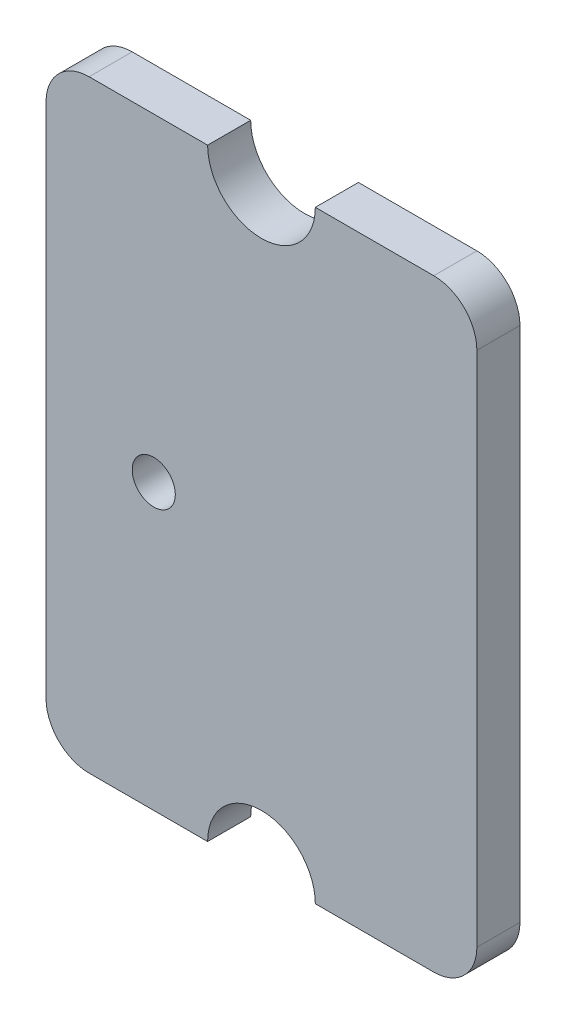
ISO-10303-21;
HEADER;
FILE_DESCRIPTION(('STEP AP214'),'2;1');
FILE_NAME('part.step','',(''),(''),'','','');
FILE_SCHEMA(('AUTOMOTIVE_DESIGN { 1 0 10303 214 1 1 1 1 }'));
ENDSEC;
DATA;
#1=APPLICATION_CONTEXT('core data for automotive mechanical design processes');
#2=APPLICATION_PROTOCOL_DEFINITION('international standard','automotive_design',2000,#1);
#3=PRODUCT_CONTEXT('',#1,'mechanical');
#4=PRODUCT('Part','Part','',(#3));
#5=PRODUCT_RELATED_PRODUCT_CATEGORY('part','',(#4));
#6=PRODUCT_DEFINITION_FORMATION('','',#4);
#7=PRODUCT_DEFINITION_CONTEXT('part definition',#1,'design');
#8=PRODUCT_DEFINITION('design','',#6,#7);
#9=PRODUCT_DEFINITION_SHAPE('','',#8);
#10=(LENGTH_UNIT() NAMED_UNIT(*) SI_UNIT(.MILLI.,.METRE.));
#11=(NAMED_UNIT(*) PLANE_ANGLE_UNIT() SI_UNIT($,.RADIAN.));
#12=(NAMED_UNIT(*) SI_UNIT($,.STERADIAN.) SOLID_ANGLE_UNIT());
#13=UNCERTAINTY_MEASURE_WITH_UNIT(LENGTH_MEASURE(1.E-05),#10,'distance_accuracy_value','');
#14=(GEOMETRIC_REPRESENTATION_CONTEXT(3) GLOBAL_UNCERTAINTY_ASSIGNED_CONTEXT((#13)) GLOBAL_UNIT_ASSIGNED_CONTEXT((#10,
#11,#12)) REPRESENTATION_CONTEXT('',''));
#15=CARTESIAN_POINT('',(0.,0.,0.));
#16=DIRECTION('',(0.,0.,1.));
#17=DIRECTION('',(1.,0.,0.));
#18=AXIS2_PLACEMENT_3D('',#15,#16,#17);
#19=CARTESIAN_POINT('',(4.,6.,1.));
#20=DIRECTION('',(0.,0.,-1.));
#21=DIRECTION('',(-1.,0.,0.));
#22=AXIS2_PLACEMENT_3D('',#19,#20,#21);
#23=PLANE('',#22);
#24=CARTESIAN_POINT('',(4.,6.,1.));
#25=DIRECTION('',(0.,0.,1.));
#26=DIRECTION('',(-1.,0.,0.));
#27=AXIS2_PLACEMENT_3D('',#24,#25,#26);
#28=CIRCLE('',#27,1.);
#29=CARTESIAN_POINT('',(5.,5.99999999999999,1.));
#30=VERTEX_POINT('',#29);
#31=CARTESIAN_POINT('',(3.99999999999999,7.,1.));
#32=VERTEX_POINT('',#31);
#33=EDGE_CURVE('E179',#30,#32,#28,.T.);
#34=ORIENTED_EDGE('',*,*,#33,.T.);
#35=DIRECTION('',(-1.,0.,0.));
#36=VECTOR('',#35,1.);
#37=CARTESIAN_POINT('',(1.25,7.,1.));
#38=LINE('',#37,#36);
#39=CARTESIAN_POINT('',(1.25,7.,1.));
#40=VERTEX_POINT('',#39);
#41=EDGE_CURVE('E107',#32,#40,#38,.T.);
#42=ORIENTED_EDGE('',*,*,#41,.T.);
#43=CARTESIAN_POINT('',(0.,7.,1.));
#44=DIRECTION('',(0.,0.,-1.));
#45=DIRECTION('',(1.,0.,0.));
#46=AXIS2_PLACEMENT_3D('',#43,#44,#45);
#47=CIRCLE('',#46,1.25);
#48=CARTESIAN_POINT('',(-1.25,7.,1.));
#49=VERTEX_POINT('',#48);
#50=EDGE_CURVE('E206',#40,#49,#47,.T.);
#51=ORIENTED_EDGE('',*,*,#50,.T.);
#52=DIRECTION('',(-1.,0.,0.));
#53=VECTOR('',#52,1.);
#54=CARTESIAN_POINT('',(-3.99999999999999,7.,1.));
#55=LINE('',#54,#53);
#56=CARTESIAN_POINT('',(-3.99999999999999,7.,1.));
#57=VERTEX_POINT('',#56);
#58=EDGE_CURVE('E225',#49,#57,#55,.T.);
#59=ORIENTED_EDGE('',*,*,#58,.T.);
#60=CARTESIAN_POINT('',(-4.,6.,1.));
#61=DIRECTION('',(0.,0.,1.));
#62=DIRECTION('',(1.,0.,0.));
#63=AXIS2_PLACEMENT_3D('',#60,#61,#62);
#64=CIRCLE('',#63,1.);
#65=CARTESIAN_POINT('',(-5.,5.99999999999999,1.));
#66=VERTEX_POINT('',#65);
#67=EDGE_CURVE('E222',#57,#66,#64,.T.);
#68=ORIENTED_EDGE('',*,*,#67,.T.);
#69=DIRECTION('',(0.,-1.,0.));
#70=VECTOR('',#69,1.);
#71=CARTESIAN_POINT('',(-5.,5.99999999999999,1.));
#72=LINE('',#71,#70);
#73=CARTESIAN_POINT('',(-5.,-5.99999999999999,1.));
#74=VERTEX_POINT('',#73);
#75=EDGE_CURVE('E224',#66,#74,#72,.T.);
#76=ORIENTED_EDGE('',*,*,#75,.T.);
#77=CARTESIAN_POINT('',(-4.,-6.,1.));
#78=DIRECTION('',(0.,0.,1.));
#79=DIRECTION('',(1.,0.,0.));
#80=AXIS2_PLACEMENT_3D('',#77,#78,#79);
#81=CIRCLE('',#80,1.);
#82=CARTESIAN_POINT('',(-3.99999999999999,-7.,1.));
#83=VERTEX_POINT('',#82);
#84=EDGE_CURVE('E227',#74,#83,#81,.T.);
#85=ORIENTED_EDGE('',*,*,#84,.T.);
#86=DIRECTION('',(1.,0.,0.));
#87=VECTOR('',#86,1.);
#88=CARTESIAN_POINT('',(-3.99999999999999,-7.,1.));
#89=LINE('',#88,#87);
#90=CARTESIAN_POINT('',(-1.25,-7.,1.));
#91=VERTEX_POINT('',#90);
#92=EDGE_CURVE('E233',#83,#91,#89,.T.);
#93=ORIENTED_EDGE('',*,*,#92,.T.);
#94=CARTESIAN_POINT('',(0.,-7.,1.));
#95=DIRECTION('',(0.,0.,-1.));
#96=DIRECTION('',(1.,0.,0.));
#97=AXIS2_PLACEMENT_3D('',#94,#95,#96);
#98=CIRCLE('',#97,1.25);
#99=CARTESIAN_POINT('',(1.25,-7.,1.));
#100=VERTEX_POINT('',#99);
#101=EDGE_CURVE('E138',#91,#100,#98,.T.);
#102=ORIENTED_EDGE('',*,*,#101,.T.);
#103=DIRECTION('',(1.,0.,0.));
#104=VECTOR('',#103,1.);
#105=CARTESIAN_POINT('',(1.25,-7.,1.));
#106=LINE('',#105,#104);
#107=CARTESIAN_POINT('',(3.99999999999999,-7.,1.));
#108=VERTEX_POINT('',#107);
#109=EDGE_CURVE('E132',#100,#108,#106,.T.);
#110=ORIENTED_EDGE('',*,*,#109,.T.);
#111=CARTESIAN_POINT('',(4.,-6.,1.));
#112=DIRECTION('',(0.,0.,1.));
#113=DIRECTION('',(1.,0.,0.));
#114=AXIS2_PLACEMENT_3D('',#111,#112,#113);
#115=CIRCLE('',#114,1.);
#116=CARTESIAN_POINT('',(5.,-6.,1.));
#117=VERTEX_POINT('',#116);
#118=EDGE_CURVE('E136',#108,#117,#115,.T.);
#119=ORIENTED_EDGE('',*,*,#118,.T.);
#120=DIRECTION('',(0.,1.,0.));
#121=VECTOR('',#120,1.);
#122=CARTESIAN_POINT('',(5.,5.99999999999999,1.));
#123=LINE('',#122,#121);
#124=EDGE_CURVE('E52',#117,#30,#123,.T.);
#125=ORIENTED_EDGE('',*,*,#124,.T.);
#126=EDGE_LOOP('',(#34,#42,#51,#59,#68,#76,#85,#93,#102,#110,#119,#125));
#127=FACE_BOUND('',#126,.T.);
#128=CARTESIAN_POINT('',(-2.5,-0.399999999999998,1.));
#129=DIRECTION('',(0.,0.,1.));
#130=DIRECTION('',(1.,0.,0.));
#131=AXIS2_PLACEMENT_3D('',#128,#129,#130);
#132=CIRCLE('',#131,0.5);
#133=CARTESIAN_POINT('',(-2.,-0.399999999999998,1.));
#134=VERTEX_POINT('',#133);
#135=EDGE_CURVE('E160',#134,#134,#132,.T.);
#136=ORIENTED_EDGE('',*,*,#135,.F.);
#137=EDGE_LOOP('',(#136));
#138=FACE_BOUND('',#137,.T.);
#139=ADVANCED_FACE('F35',(#127,#138),#23,.F.);
#140=CARTESIAN_POINT('',(4.,6.,0.));
#141=DIRECTION('',(0.,0.,-1.));
#142=DIRECTION('',(-1.,0.,0.));
#143=AXIS2_PLACEMENT_3D('',#140,#141,#142);
#144=PLANE('',#143);
#145=CARTESIAN_POINT('',(4.,6.,0.));
#146=DIRECTION('',(0.,0.,1.));
#147=DIRECTION('',(-1.,0.,0.));
#148=AXIS2_PLACEMENT_3D('',#145,#146,#147);
#149=CIRCLE('',#148,1.);
#150=CARTESIAN_POINT('',(5.,5.99999999999999,0.));
#151=VERTEX_POINT('',#150);
#152=CARTESIAN_POINT('',(3.99999999999999,7.,0.));
#153=VERTEX_POINT('',#152);
#154=EDGE_CURVE('E156',#151,#153,#149,.T.);
#155=ORIENTED_EDGE('',*,*,#154,.F.);
#156=DIRECTION('',(0.,1.,0.));
#157=VECTOR('',#156,1.);
#158=CARTESIAN_POINT('',(5.,5.99999999999999,0.));
#159=LINE('',#158,#157);
#160=CARTESIAN_POINT('',(5.,-6.,0.));
#161=VERTEX_POINT('',#160);
#162=EDGE_CURVE('E99',#161,#151,#159,.T.);
#163=ORIENTED_EDGE('',*,*,#162,.F.);
#164=CARTESIAN_POINT('',(4.,-6.,0.));
#165=DIRECTION('',(0.,0.,1.));
#166=DIRECTION('',(1.,0.,0.));
#167=AXIS2_PLACEMENT_3D('',#164,#165,#166);
#168=CIRCLE('',#167,1.);
#169=CARTESIAN_POINT('',(3.99999999999999,-7.,0.));
#170=VERTEX_POINT('',#169);
#171=EDGE_CURVE('E93',#170,#161,#168,.T.);
#172=ORIENTED_EDGE('',*,*,#171,.F.);
#173=DIRECTION('',(1.,0.,0.));
#174=VECTOR('',#173,1.);
#175=CARTESIAN_POINT('',(1.25,-7.,0.));
#176=LINE('',#175,#174);
#177=CARTESIAN_POINT('',(1.25,-7.,0.));
#178=VERTEX_POINT('',#177);
#179=EDGE_CURVE('E146',#178,#170,#176,.T.);
#180=ORIENTED_EDGE('',*,*,#179,.F.);
#181=CARTESIAN_POINT('',(0.,-7.,0.));
#182=DIRECTION('',(0.,0.,-1.));
#183=DIRECTION('',(1.,0.,0.));
#184=AXIS2_PLACEMENT_3D('',#181,#182,#183);
#185=CIRCLE('',#184,1.25);
#186=CARTESIAN_POINT('',(-1.25,-7.,0.));
#187=VERTEX_POINT('',#186);
#188=EDGE_CURVE('E174',#187,#178,#185,.T.);
#189=ORIENTED_EDGE('',*,*,#188,.F.);
#190=DIRECTION('',(1.,0.,0.));
#191=VECTOR('',#190,1.);
#192=CARTESIAN_POINT('',(-3.99999999999999,-7.,0.));
#193=LINE('',#192,#191);
#194=CARTESIAN_POINT('',(-3.99999999999999,-7.,0.));
#195=VERTEX_POINT('',#194);
#196=EDGE_CURVE('E172',#195,#187,#193,.T.);
#197=ORIENTED_EDGE('',*,*,#196,.F.);
#198=CARTESIAN_POINT('',(-4.,-6.,0.));
#199=DIRECTION('',(0.,0.,1.));
#200=DIRECTION('',(1.,0.,0.));
#201=AXIS2_PLACEMENT_3D('',#198,#199,#200);
#202=CIRCLE('',#201,1.);
#203=CARTESIAN_POINT('',(-5.,-5.99999999999999,0.));
#204=VERTEX_POINT('',#203);
#205=EDGE_CURVE('E170',#204,#195,#202,.T.);
#206=ORIENTED_EDGE('',*,*,#205,.F.);
#207=DIRECTION('',(0.,-1.,0.));
#208=VECTOR('',#207,1.);
#209=CARTESIAN_POINT('',(-5.,5.99999999999999,0.));
#210=LINE('',#209,#208);
#211=CARTESIAN_POINT('',(-5.,5.99999999999999,0.));
#212=VERTEX_POINT('',#211);
#213=EDGE_CURVE('E168',#212,#204,#210,.T.);
#214=ORIENTED_EDGE('',*,*,#213,.F.);
#215=CARTESIAN_POINT('',(-4.,6.,0.));
#216=DIRECTION('',(0.,0.,1.));
#217=DIRECTION('',(1.,0.,0.));
#218=AXIS2_PLACEMENT_3D('',#215,#216,#217);
#219=CIRCLE('',#218,1.);
#220=CARTESIAN_POINT('',(-3.99999999999999,7.,0.));
#221=VERTEX_POINT('',#220);
#222=EDGE_CURVE('E166',#221,#212,#219,.T.);
#223=ORIENTED_EDGE('',*,*,#222,.F.);
#224=DIRECTION('',(-1.,0.,0.));
#225=VECTOR('',#224,1.);
#226=CARTESIAN_POINT('',(-3.99999999999999,7.,0.));
#227=LINE('',#226,#225);
#228=CARTESIAN_POINT('',(-1.25,7.,0.));
#229=VERTEX_POINT('',#228);
#230=EDGE_CURVE('E164',#229,#221,#227,.T.);
#231=ORIENTED_EDGE('',*,*,#230,.F.);
#232=CARTESIAN_POINT('',(0.,7.,0.));
#233=DIRECTION('',(0.,0.,-1.));
#234=DIRECTION('',(1.,0.,0.));
#235=AXIS2_PLACEMENT_3D('',#232,#233,#234);
#236=CIRCLE('',#235,1.25);
#237=CARTESIAN_POINT('',(1.25,7.,0.));
#238=VERTEX_POINT('',#237);
#239=EDGE_CURVE('E162',#238,#229,#236,.T.);
#240=ORIENTED_EDGE('',*,*,#239,.F.);
#241=DIRECTION('',(-1.,0.,0.));
#242=VECTOR('',#241,1.);
#243=CARTESIAN_POINT('',(1.25,7.,0.));
#244=LINE('',#243,#242);
#245=EDGE_CURVE('E159',#153,#238,#244,.T.);
#246=ORIENTED_EDGE('',*,*,#245,.F.);
#247=EDGE_LOOP('',(#155,#163,#172,#180,#189,#197,#206,#214,#223,#231,#240,#246));
#248=FACE_BOUND('',#247,.T.);
#249=CARTESIAN_POINT('',(-2.5,-0.399999999999998,0.));
#250=DIRECTION('',(0.,0.,1.));
#251=DIRECTION('',(1.,0.,0.));
#252=AXIS2_PLACEMENT_3D('',#249,#250,#251);
#253=CIRCLE('',#252,0.5);
#254=CARTESIAN_POINT('',(-2.,-0.399999999999998,0.));
#255=VERTEX_POINT('',#254);
#256=EDGE_CURVE('E380',#255,#255,#253,.T.);
#257=ORIENTED_EDGE('',*,*,#256,.T.);
#258=EDGE_LOOP('',(#257));
#259=FACE_BOUND('',#258,.T.);
#260=ADVANCED_FACE('F210',(#248,#259),#144,.T.);
#261=CARTESIAN_POINT('',(4.,6.,1.));
#262=DIRECTION('',(0.,0.,-1.));
#263=DIRECTION('',(-1.,0.,0.));
#264=AXIS2_PLACEMENT_3D('',#261,#262,#263);
#265=CYLINDRICAL_SURFACE('',#264,1.);
#266=ORIENTED_EDGE('',*,*,#154,.T.);
#267=DIRECTION('',(0.,0.,-1.));
#268=VECTOR('',#267,1.);
#269=CARTESIAN_POINT('',(3.99999999999999,7.,1.));
#270=LINE('',#269,#268);
#271=EDGE_CURVE('E11',#32,#153,#270,.T.);
#272=ORIENTED_EDGE('',*,*,#271,.F.);
#273=ORIENTED_EDGE('',*,*,#33,.F.);
#274=DIRECTION('',(0.,0.,-1.));
#275=VECTOR('',#274,1.);
#276=CARTESIAN_POINT('',(5.,5.99999999999999,1.));
#277=LINE('',#276,#275);
#278=EDGE_CURVE('E152',#30,#151,#277,.T.);
#279=ORIENTED_EDGE('',*,*,#278,.T.);
#280=EDGE_LOOP('',(#266,#272,#273,#279));
#281=FACE_BOUND('',#280,.T.);
#282=ADVANCED_FACE('F37',(#281),#265,.T.);
#283=CARTESIAN_POINT('',(1.25,7.,1.));
#284=DIRECTION('',(0.,-1.,0.));
#285=DIRECTION('',(0.,0.,-1.));
#286=AXIS2_PLACEMENT_3D('',#283,#284,#285);
#287=PLANE('',#286);
#288=ORIENTED_EDGE('',*,*,#245,.T.);
#289=DIRECTION('',(0.,0.,-1.));
#290=VECTOR('',#289,1.);
#291=CARTESIAN_POINT('',(1.25,7.,1.));
#292=LINE('',#291,#290);
#293=EDGE_CURVE('E44',#40,#238,#292,.T.);
#294=ORIENTED_EDGE('',*,*,#293,.F.);
#295=ORIENTED_EDGE('',*,*,#41,.F.);
#296=ORIENTED_EDGE('',*,*,#271,.T.);
#297=EDGE_LOOP('',(#288,#294,#295,#296));
#298=FACE_BOUND('',#297,.T.);
#299=ADVANCED_FACE('F267',(#298),#287,.F.);
#300=CARTESIAN_POINT('',(0.,7.,1.));
#301=DIRECTION('',(0.,0.,-1.));
#302=DIRECTION('',(-1.,0.,0.));
#303=AXIS2_PLACEMENT_3D('',#300,#301,#302);
#304=CYLINDRICAL_SURFACE('',#303,1.25);
#305=ORIENTED_EDGE('',*,*,#239,.T.);
#306=DIRECTION('',(0.,0.,-1.));
#307=VECTOR('',#306,1.);
#308=CARTESIAN_POINT('',(-1.25,7.,1.));
#309=LINE('',#308,#307);
#310=EDGE_CURVE('E198',#49,#229,#309,.T.);
#311=ORIENTED_EDGE('',*,*,#310,.F.);
#312=ORIENTED_EDGE('',*,*,#50,.F.);
#313=ORIENTED_EDGE('',*,*,#293,.T.);
#314=EDGE_LOOP('',(#305,#311,#312,#313));
#315=FACE_BOUND('',#314,.T.);
#316=ADVANCED_FACE('F204',(#315),#304,.F.);
#317=CARTESIAN_POINT('',(-3.99999999999999,7.,1.));
#318=DIRECTION('',(0.,-1.,0.));
#319=DIRECTION('',(0.,0.,-1.));
#320=AXIS2_PLACEMENT_3D('',#317,#318,#319);
#321=PLANE('',#320);
#322=ORIENTED_EDGE('',*,*,#230,.T.);
#323=DIRECTION('',(0.,0.,-1.));
#324=VECTOR('',#323,1.);
#325=CARTESIAN_POINT('',(-3.99999999999999,7.,1.));
#326=LINE('',#325,#324);
#327=EDGE_CURVE('E195',#57,#221,#326,.T.);
#328=ORIENTED_EDGE('',*,*,#327,.F.);
#329=ORIENTED_EDGE('',*,*,#58,.F.);
#330=ORIENTED_EDGE('',*,*,#310,.T.);
#331=EDGE_LOOP('',(#322,#328,#329,#330));
#332=FACE_BOUND('',#331,.T.);
#333=ADVANCED_FACE('F216',(#332),#321,.F.);
#334=CARTESIAN_POINT('',(-4.,6.,1.));
#335=DIRECTION('',(0.,0.,-1.));
#336=DIRECTION('',(-1.,0.,0.));
#337=AXIS2_PLACEMENT_3D('',#334,#335,#336);
#338=CYLINDRICAL_SURFACE('',#337,1.);
#339=ORIENTED_EDGE('',*,*,#222,.T.);
#340=DIRECTION('',(0.,0.,-1.));
#341=VECTOR('',#340,1.);
#342=CARTESIAN_POINT('',(-5.,5.99999999999999,1.));
#343=LINE('',#342,#341);
#344=EDGE_CURVE('E192',#66,#212,#343,.T.);
#345=ORIENTED_EDGE('',*,*,#344,.F.);
#346=ORIENTED_EDGE('',*,*,#67,.F.);
#347=ORIENTED_EDGE('',*,*,#327,.T.);
#348=EDGE_LOOP('',(#339,#345,#346,#347));
#349=FACE_BOUND('',#348,.T.);
#350=ADVANCED_FACE('F220',(#349),#338,.T.);
#351=CARTESIAN_POINT('',(-5.,5.99999999999999,1.));
#352=DIRECTION('',(1.,0.,0.));
#353=DIRECTION('',(0.,1.,0.));
#354=AXIS2_PLACEMENT_3D('',#351,#352,#353);
#355=PLANE('',#354);
#356=ORIENTED_EDGE('',*,*,#213,.T.);
#357=DIRECTION('',(0.,0.,-1.));
#358=VECTOR('',#357,1.);
#359=CARTESIAN_POINT('',(-5.,-5.99999999999999,1.));
#360=LINE('',#359,#358);
#361=EDGE_CURVE('E189',#74,#204,#360,.T.);
#362=ORIENTED_EDGE('',*,*,#361,.F.);
#363=ORIENTED_EDGE('',*,*,#75,.F.);
#364=ORIENTED_EDGE('',*,*,#344,.T.);
#365=EDGE_LOOP('',(#356,#362,#363,#364));
#366=FACE_BOUND('',#365,.T.);
#367=ADVANCED_FACE('F280',(#366),#355,.F.);
#368=CARTESIAN_POINT('',(-4.,-6.,1.));
#369=DIRECTION('',(0.,0.,-1.));
#370=DIRECTION('',(-1.,0.,0.));
#371=AXIS2_PLACEMENT_3D('',#368,#369,#370);
#372=CYLINDRICAL_SURFACE('',#371,1.);
#373=ORIENTED_EDGE('',*,*,#205,.T.);
#374=DIRECTION('',(0.,0.,-1.));
#375=VECTOR('',#374,1.);
#376=CARTESIAN_POINT('',(-3.99999999999999,-7.,1.));
#377=LINE('',#376,#375);
#378=EDGE_CURVE('E186',#83,#195,#377,.T.);
#379=ORIENTED_EDGE('',*,*,#378,.F.);
#380=ORIENTED_EDGE('',*,*,#84,.F.);
#381=ORIENTED_EDGE('',*,*,#361,.T.);
#382=EDGE_LOOP('',(#373,#379,#380,#381));
#383=FACE_BOUND('',#382,.T.);
#384=ADVANCED_FACE('F283',(#383),#372,.T.);
#385=CARTESIAN_POINT('',(-3.99999999999999,-7.,1.));
#386=DIRECTION('',(0.,1.,0.));
#387=DIRECTION('',(0.,0.,1.));
#388=AXIS2_PLACEMENT_3D('',#385,#386,#387);
#389=PLANE('',#388);
#390=ORIENTED_EDGE('',*,*,#196,.T.);
#391=DIRECTION('',(0.,0.,-1.));
#392=VECTOR('',#391,1.);
#393=CARTESIAN_POINT('',(-1.25,-7.,1.));
#394=LINE('',#393,#392);
#395=EDGE_CURVE('E183',#91,#187,#394,.T.);
#396=ORIENTED_EDGE('',*,*,#395,.F.);
#397=ORIENTED_EDGE('',*,*,#92,.F.);
#398=ORIENTED_EDGE('',*,*,#378,.T.);
#399=EDGE_LOOP('',(#390,#396,#397,#398));
#400=FACE_BOUND('',#399,.T.);
#401=ADVANCED_FACE('F239',(#400),#389,.F.);
#402=CARTESIAN_POINT('',(0.,-7.,1.));
#403=DIRECTION('',(0.,0.,-1.));
#404=DIRECTION('',(-1.,0.,0.));
#405=AXIS2_PLACEMENT_3D('',#402,#403,#404);
#406=CYLINDRICAL_SURFACE('',#405,1.25);
#407=ORIENTED_EDGE('',*,*,#188,.T.);
#408=DIRECTION('',(0.,0.,-1.));
#409=VECTOR('',#408,1.);
#410=CARTESIAN_POINT('',(1.25,-7.,1.));
#411=LINE('',#410,#409);
#412=EDGE_CURVE('E147',#100,#178,#411,.T.);
#413=ORIENTED_EDGE('',*,*,#412,.F.);
#414=ORIENTED_EDGE('',*,*,#101,.F.);
#415=ORIENTED_EDGE('',*,*,#395,.T.);
#416=EDGE_LOOP('',(#407,#413,#414,#415));
#417=FACE_BOUND('',#416,.T.);
#418=ADVANCED_FACE('F243',(#417),#406,.F.);
#419=CARTESIAN_POINT('',(1.25,-7.,1.));
#420=DIRECTION('',(0.,1.,0.));
#421=DIRECTION('',(0.,0.,1.));
#422=AXIS2_PLACEMENT_3D('',#419,#420,#421);
#423=PLANE('',#422);
#424=ORIENTED_EDGE('',*,*,#179,.T.);
#425=DIRECTION('',(0.,0.,-1.));
#426=VECTOR('',#425,1.);
#427=CARTESIAN_POINT('',(3.99999999999999,-7.,1.));
#428=LINE('',#427,#426);
#429=EDGE_CURVE('E143',#108,#170,#428,.T.);
#430=ORIENTED_EDGE('',*,*,#429,.F.);
#431=ORIENTED_EDGE('',*,*,#109,.F.);
#432=ORIENTED_EDGE('',*,*,#412,.T.);
#433=EDGE_LOOP('',(#424,#430,#431,#432));
#434=FACE_BOUND('',#433,.T.);
#435=ADVANCED_FACE('F144',(#434),#423,.F.);
#436=CARTESIAN_POINT('',(4.,-6.,1.));
#437=DIRECTION('',(0.,0.,-1.));
#438=DIRECTION('',(-1.,0.,0.));
#439=AXIS2_PLACEMENT_3D('',#436,#437,#438);
#440=CYLINDRICAL_SURFACE('',#439,1.);
#441=ORIENTED_EDGE('',*,*,#171,.T.);
#442=DIRECTION('',(0.,0.,-1.));
#443=VECTOR('',#442,1.);
#444=CARTESIAN_POINT('',(5.,-6.,1.));
#445=LINE('',#444,#443);
#446=EDGE_CURVE('E148',#117,#161,#445,.T.);
#447=ORIENTED_EDGE('',*,*,#446,.F.);
#448=ORIENTED_EDGE('',*,*,#118,.F.);
#449=ORIENTED_EDGE('',*,*,#429,.T.);
#450=EDGE_LOOP('',(#441,#447,#448,#449));
#451=FACE_BOUND('',#450,.T.);
#452=ADVANCED_FACE('F150',(#451),#440,.T.);
#453=CARTESIAN_POINT('',(5.,5.99999999999999,1.));
#454=DIRECTION('',(-1.,0.,0.));
#455=DIRECTION('',(0.,-1.,0.));
#456=AXIS2_PLACEMENT_3D('',#453,#454,#455);
#457=PLANE('',#456);
#458=ORIENTED_EDGE('',*,*,#162,.T.);
#459=ORIENTED_EDGE('',*,*,#278,.F.);
#460=ORIENTED_EDGE('',*,*,#124,.F.);
#461=ORIENTED_EDGE('',*,*,#446,.T.);
#462=EDGE_LOOP('',(#458,#459,#460,#461));
#463=FACE_BOUND('',#462,.T.);
#464=ADVANCED_FACE('F247',(#463),#457,.F.);
#465=CARTESIAN_POINT('',(-2.5,-0.399999999999998,1.));
#466=DIRECTION('',(0.,0.,-1.));
#467=DIRECTION('',(-1.,0.,0.));
#468=AXIS2_PLACEMENT_3D('',#465,#466,#467);
#469=CYLINDRICAL_SURFACE('',#468,0.5);
#470=ORIENTED_EDGE('',*,*,#135,.T.);
#471=EDGE_LOOP('',(#470));
#472=FACE_BOUND('',#471,.T.);
#473=ORIENTED_EDGE('',*,*,#256,.F.);
#474=EDGE_LOOP('',(#473));
#475=FACE_BOUND('',#474,.T.);
#476=ADVANCED_FACE('F249',(#472,#475),#469,.F.);
#477=CLOSED_SHELL('',(#139,#260,#282,#299,#316,#333,#350,#367,#384,#401,#418,#435,#452,#464,#476));
#478=MANIFOLD_SOLID_BREP('B2',#477);
#479=ADVANCED_BREP_SHAPE_REPRESENTATION('',(#18,#478),#14);
#480=SHAPE_DEFINITION_REPRESENTATION(#9,#479);
ENDSEC;
END-ISO-10303-21;
